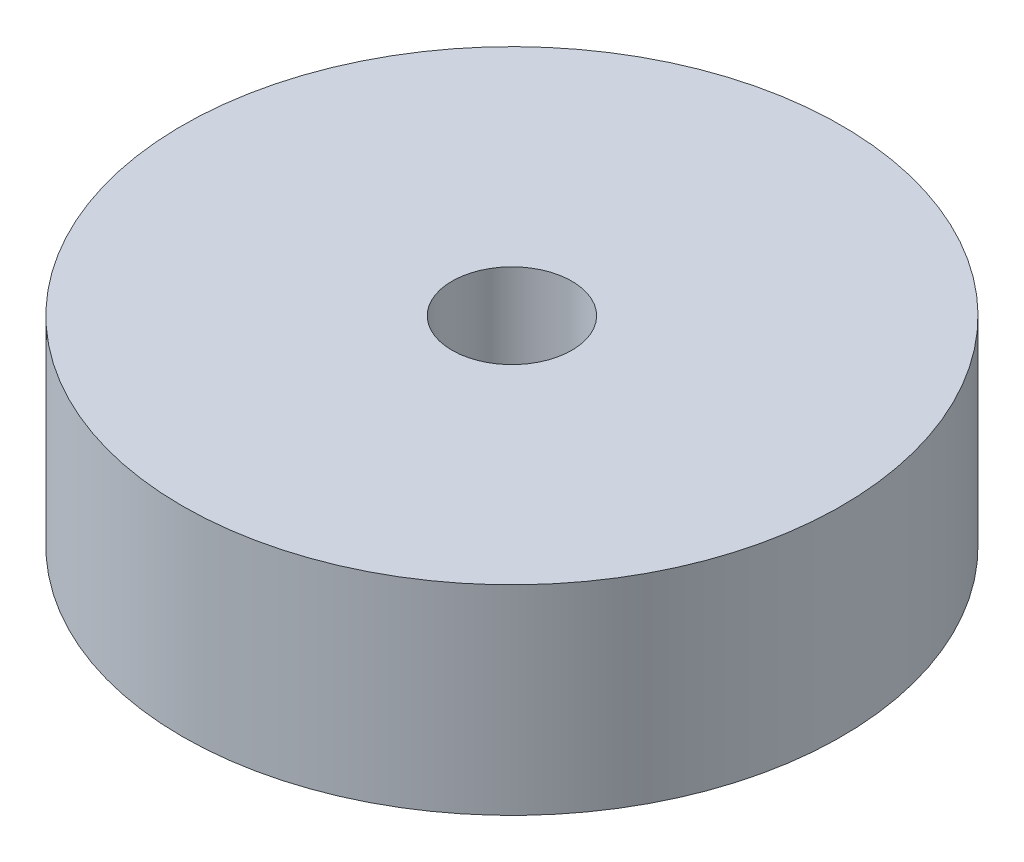
ISO-10303-21;
HEADER;
FILE_DESCRIPTION(('STEP AP214'),'2;1');
FILE_NAME('part.step','',(''),(''),'','','');
FILE_SCHEMA(('AUTOMOTIVE_DESIGN { 1 0 10303 214 1 1 1 1 }'));
ENDSEC;
DATA;
#1=APPLICATION_CONTEXT('core data for automotive mechanical design processes');
#2=APPLICATION_PROTOCOL_DEFINITION('international standard','automotive_design',2000,#1);
#3=PRODUCT_CONTEXT('',#1,'mechanical');
#4=PRODUCT('Part','Part','',(#3));
#5=PRODUCT_RELATED_PRODUCT_CATEGORY('part','',(#4));
#6=PRODUCT_DEFINITION_FORMATION('','',#4);
#7=PRODUCT_DEFINITION_CONTEXT('part definition',#1,'design');
#8=PRODUCT_DEFINITION('design','',#6,#7);
#9=PRODUCT_DEFINITION_SHAPE('','',#8);
#10=(LENGTH_UNIT() NAMED_UNIT(*) SI_UNIT(.MILLI.,.METRE.));
#11=(NAMED_UNIT(*) PLANE_ANGLE_UNIT() SI_UNIT($,.RADIAN.));
#12=(NAMED_UNIT(*) SI_UNIT($,.STERADIAN.) SOLID_ANGLE_UNIT());
#13=UNCERTAINTY_MEASURE_WITH_UNIT(LENGTH_MEASURE(1.E-05),#10,'distance_accuracy_value','');
#14=(GEOMETRIC_REPRESENTATION_CONTEXT(3) GLOBAL_UNCERTAINTY_ASSIGNED_CONTEXT((#13)) GLOBAL_UNIT_ASSIGNED_CONTEXT((#10,
#11,#12)) REPRESENTATION_CONTEXT('',''));
#15=CARTESIAN_POINT('',(0.,0.,0.));
#16=DIRECTION('',(0.,0.,1.));
#17=DIRECTION('',(1.,0.,0.));
#18=AXIS2_PLACEMENT_3D('',#15,#16,#17);
#19=CARTESIAN_POINT('',(0.,20.,0.));
#20=DIRECTION('',(0.,-1.,0.));
#21=DIRECTION('',(0.,0.,-1.));
#22=AXIS2_PLACEMENT_3D('',#19,#20,#21);
#23=CYLINDRICAL_SURFACE('',#22,33.);
#24=CARTESIAN_POINT('',(0.,20.,0.));
#25=DIRECTION('',(0.,1.,0.));
#26=DIRECTION('',(0.,0.,1.));
#27=AXIS2_PLACEMENT_3D('',#24,#25,#26);
#28=CIRCLE('',#27,33.);
#29=CARTESIAN_POINT('',(0.,20.,33.));
#30=VERTEX_POINT('',#29);
#31=EDGE_CURVE('E10',#30,#30,#28,.T.);
#32=ORIENTED_EDGE('',*,*,#31,.F.);
#33=EDGE_LOOP('',(#32));
#34=FACE_BOUND('',#33,.T.);
#35=CARTESIAN_POINT('',(0.,0.,0.));
#36=DIRECTION('',(0.,1.,0.));
#37=DIRECTION('',(0.,0.,1.));
#38=AXIS2_PLACEMENT_3D('',#35,#36,#37);
#39=CIRCLE('',#38,33.);
#40=CARTESIAN_POINT('',(0.,0.,33.));
#41=VERTEX_POINT('',#40);
#42=EDGE_CURVE('E33',#41,#41,#39,.T.);
#43=ORIENTED_EDGE('',*,*,#42,.T.);
#44=EDGE_LOOP('',(#43));
#45=FACE_BOUND('',#44,.T.);
#46=ADVANCED_FACE('F30',(#34,#45),#23,.T.);
#47=CARTESIAN_POINT('',(0.,20.,0.));
#48=DIRECTION('',(0.,1.,0.));
#49=DIRECTION('',(0.,0.,1.));
#50=AXIS2_PLACEMENT_3D('',#47,#48,#49);
#51=PLANE('',#50);
#52=CARTESIAN_POINT('',(0.,20.,0.));
#53=DIRECTION('',(0.,1.,0.));
#54=DIRECTION('',(0.,0.,1.));
#55=AXIS2_PLACEMENT_3D('',#52,#53,#54);
#56=CIRCLE('',#55,6.);
#57=CARTESIAN_POINT('',(0.,20.,6.));
#58=VERTEX_POINT('',#57);
#59=EDGE_CURVE('E42',#58,#58,#56,.T.);
#60=ORIENTED_EDGE('',*,*,#59,.F.);
#61=EDGE_LOOP('',(#60));
#62=FACE_BOUND('',#61,.T.);
#63=ORIENTED_EDGE('',*,*,#31,.T.);
#64=EDGE_LOOP('',(#63));
#65=FACE_BOUND('',#64,.T.);
#66=ADVANCED_FACE('F57',(#62,#65),#51,.T.);
#67=CARTESIAN_POINT('',(0.,0.,0.));
#68=DIRECTION('',(0.,1.,0.));
#69=DIRECTION('',(0.,0.,1.));
#70=AXIS2_PLACEMENT_3D('',#67,#68,#69);
#71=PLANE('',#70);
#72=CARTESIAN_POINT('',(0.,0.,0.));
#73=DIRECTION('',(0.,1.,0.));
#74=DIRECTION('',(0.,0.,1.));
#75=AXIS2_PLACEMENT_3D('',#72,#73,#74);
#76=CIRCLE('',#75,6.);
#77=CARTESIAN_POINT('',(0.,0.,6.));
#78=VERTEX_POINT('',#77);
#79=EDGE_CURVE('E40',#78,#78,#76,.T.);
#80=ORIENTED_EDGE('',*,*,#79,.T.);
#81=EDGE_LOOP('',(#80));
#82=FACE_BOUND('',#81,.T.);
#83=ORIENTED_EDGE('',*,*,#42,.F.);
#84=EDGE_LOOP('',(#83));
#85=FACE_BOUND('',#84,.T.);
#86=ADVANCED_FACE('F48',(#82,#85),#71,.F.);
#87=CARTESIAN_POINT('',(0.,0.,0.));
#88=DIRECTION('',(0.,1.,0.));
#89=DIRECTION('',(0.,0.,1.));
#90=AXIS2_PLACEMENT_3D('',#87,#88,#89);
#91=CYLINDRICAL_SURFACE('',#90,6.);
#92=ORIENTED_EDGE('',*,*,#79,.F.);
#93=EDGE_LOOP('',(#92));
#94=FACE_BOUND('',#93,.T.);
#95=ORIENTED_EDGE('',*,*,#59,.T.);
#96=EDGE_LOOP('',(#95));
#97=FACE_BOUND('',#96,.T.);
#98=ADVANCED_FACE('F51',(#94,#97),#91,.F.);
#99=CLOSED_SHELL('',(#46,#66,#86,#98));
#100=MANIFOLD_SOLID_BREP('B2',#99);
#101=ADVANCED_BREP_SHAPE_REPRESENTATION('',(#18,#100),#14);
#102=SHAPE_DEFINITION_REPRESENTATION(#9,#101);
ENDSEC;
END-ISO-10303-21;
